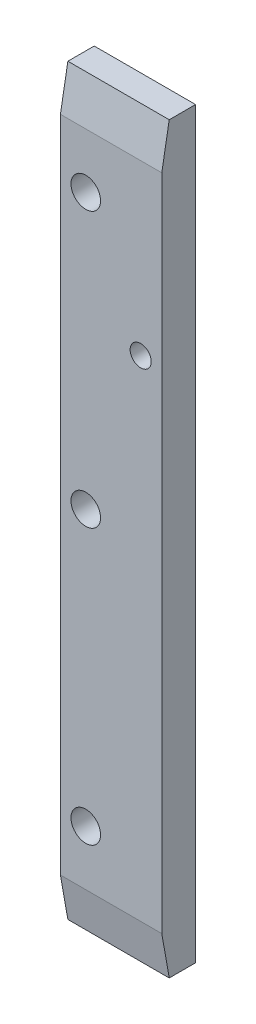
ISO-10303-21;
HEADER;
FILE_DESCRIPTION(('STEP AP214'),'2;1');
FILE_NAME('part.step','',(''),(''),'','','');
FILE_SCHEMA(('AUTOMOTIVE_DESIGN { 1 0 10303 214 1 1 1 1 }'));
ENDSEC;
DATA;
#1=APPLICATION_CONTEXT('core data for automotive mechanical design processes');
#2=APPLICATION_PROTOCOL_DEFINITION('international standard','automotive_design',2000,#1);
#3=PRODUCT_CONTEXT('',#1,'mechanical');
#4=PRODUCT('Part','Part','',(#3));
#5=PRODUCT_RELATED_PRODUCT_CATEGORY('part','',(#4));
#6=PRODUCT_DEFINITION_FORMATION('','',#4);
#7=PRODUCT_DEFINITION_CONTEXT('part definition',#1,'design');
#8=PRODUCT_DEFINITION('design','',#6,#7);
#9=PRODUCT_DEFINITION_SHAPE('','',#8);
#10=(LENGTH_UNIT() NAMED_UNIT(*) SI_UNIT(.MILLI.,.METRE.));
#11=(NAMED_UNIT(*) PLANE_ANGLE_UNIT() SI_UNIT($,.RADIAN.));
#12=(NAMED_UNIT(*) SI_UNIT($,.STERADIAN.) SOLID_ANGLE_UNIT());
#13=UNCERTAINTY_MEASURE_WITH_UNIT(LENGTH_MEASURE(1.E-05),#10,'distance_accuracy_value','');
#14=(GEOMETRIC_REPRESENTATION_CONTEXT(3) GLOBAL_UNCERTAINTY_ASSIGNED_CONTEXT((#13)) GLOBAL_UNIT_ASSIGNED_CONTEXT((#10,
#11,#12)) REPRESENTATION_CONTEXT('',''));
#15=CARTESIAN_POINT('',(0.,0.,0.));
#16=DIRECTION('',(0.,0.,1.));
#17=DIRECTION('',(1.,0.,0.));
#18=AXIS2_PLACEMENT_3D('',#15,#16,#17);
#19=CARTESIAN_POINT('',(0.,0.,4.));
#20=DIRECTION('',(0.,0.,-1.));
#21=DIRECTION('',(-1.,0.,0.));
#22=AXIS2_PLACEMENT_3D('',#19,#20,#21);
#23=PLANE('',#22);
#24=CARTESIAN_POINT('',(-2.50000000000001,-25.,4.));
#25=DIRECTION('',(0.,0.,1.));
#26=DIRECTION('',(1.,0.,0.));
#27=AXIS2_PLACEMENT_3D('',#24,#25,#26);
#28=CIRCLE('',#27,1.24999999999999);
#29=CARTESIAN_POINT('',(-1.25000000000002,-25.,4.));
#30=VERTEX_POINT('',#29);
#31=EDGE_CURVE('E131',#30,#30,#28,.T.);
#32=ORIENTED_EDGE('',*,*,#31,.F.);
#33=EDGE_LOOP('',(#32));
#34=FACE_BOUND('',#33,.T.);
#35=DIRECTION('',(0.,1.,0.));
#36=VECTOR('',#35,1.);
#37=CARTESIAN_POINT('',(0.,-83.,4.));
#38=LINE('',#37,#36);
#39=CARTESIAN_POINT('',(0.,-82.9999999999999,4.));
#40=VERTEX_POINT('',#39);
#41=CARTESIAN_POINT('',(0.,-5.00000000000013,4.));
#42=VERTEX_POINT('',#41);
#43=EDGE_CURVE('E104',#40,#42,#38,.T.);
#44=ORIENTED_EDGE('',*,*,#43,.T.);
#45=DIRECTION('',(-1.,0.,0.));
#46=VECTOR('',#45,1.);
#47=CARTESIAN_POINT('',(0.,-5.00000000000013,4.));
#48=LINE('',#47,#46);
#49=CARTESIAN_POINT('',(-12.,-5.00000000000013,4.));
#50=VERTEX_POINT('',#49);
#51=EDGE_CURVE('E141',#42,#50,#48,.T.);
#52=ORIENTED_EDGE('',*,*,#51,.T.);
#53=DIRECTION('',(0.,-1.,0.));
#54=VECTOR('',#53,1.);
#55=CARTESIAN_POINT('',(-12.,-4.99999999999998,4.));
#56=LINE('',#55,#54);
#57=CARTESIAN_POINT('',(-12.,-82.9999999999999,4.));
#58=VERTEX_POINT('',#57);
#59=EDGE_CURVE('E119',#50,#58,#56,.T.);
#60=ORIENTED_EDGE('',*,*,#59,.T.);
#61=DIRECTION('',(1.,0.,0.));
#62=VECTOR('',#61,1.);
#63=CARTESIAN_POINT('',(0.,-82.9999999999999,4.));
#64=LINE('',#63,#62);
#65=EDGE_CURVE('E93',#58,#40,#64,.T.);
#66=ORIENTED_EDGE('',*,*,#65,.T.);
#67=EDGE_LOOP('',(#44,#52,#60,#66));
#68=FACE_BOUND('',#67,.T.);
#69=CARTESIAN_POINT('',(-8.9999999999999,-76.5,4.));
#70=DIRECTION('',(0.,0.,1.));
#71=DIRECTION('',(1.,0.,0.));
#72=AXIS2_PLACEMENT_3D('',#69,#70,#71);
#73=CIRCLE('',#72,1.74999999999992);
#74=CARTESIAN_POINT('',(-7.24999999999998,-76.5,4.));
#75=VERTEX_POINT('',#74);
#76=EDGE_CURVE('E112',#75,#75,#73,.T.);
#77=ORIENTED_EDGE('',*,*,#76,.F.);
#78=EDGE_LOOP('',(#77));
#79=FACE_BOUND('',#78,.T.);
#80=CARTESIAN_POINT('',(-8.9999999999999,-44.,4.));
#81=DIRECTION('',(0.,0.,1.));
#82=DIRECTION('',(1.,0.,0.));
#83=AXIS2_PLACEMENT_3D('',#80,#81,#82);
#84=CIRCLE('',#83,1.74999999999992);
#85=CARTESIAN_POINT('',(-7.24999999999998,-44.,4.));
#86=VERTEX_POINT('',#85);
#87=EDGE_CURVE('E156',#86,#86,#84,.T.);
#88=ORIENTED_EDGE('',*,*,#87,.F.);
#89=EDGE_LOOP('',(#88));
#90=FACE_BOUND('',#89,.T.);
#91=CARTESIAN_POINT('',(-8.9999999999999,-11.5,4.));
#92=DIRECTION('',(0.,0.,1.));
#93=DIRECTION('',(1.,0.,0.));
#94=AXIS2_PLACEMENT_3D('',#91,#92,#93);
#95=CIRCLE('',#94,1.74999999999992);
#96=CARTESIAN_POINT('',(-7.24999999999998,-11.5,4.));
#97=VERTEX_POINT('',#96);
#98=EDGE_CURVE('E161',#97,#97,#95,.T.);
#99=ORIENTED_EDGE('',*,*,#98,.F.);
#100=EDGE_LOOP('',(#99));
#101=FACE_BOUND('',#100,.T.);
#102=ADVANCED_FACE('F37',(#34,#68,#79,#90,#101),#23,.F.);
#103=CARTESIAN_POINT('',(0.,0.,0.));
#104=DIRECTION('',(0.,0.,-1.));
#105=DIRECTION('',(-1.,0.,0.));
#106=AXIS2_PLACEMENT_3D('',#103,#104,#105);
#107=PLANE('',#106);
#108=CARTESIAN_POINT('',(-2.50000000000001,-25.,0.));
#109=DIRECTION('',(0.,0.,-1.));
#110=DIRECTION('',(-1.,0.,0.));
#111=AXIS2_PLACEMENT_3D('',#108,#109,#110);
#112=CIRCLE('',#111,1.24999999999999);
#113=CARTESIAN_POINT('',(-3.75,-25.,0.));
#114=VERTEX_POINT('',#113);
#115=EDGE_CURVE('E127',#114,#114,#112,.T.);
#116=ORIENTED_EDGE('',*,*,#115,.F.);
#117=EDGE_LOOP('',(#116));
#118=FACE_BOUND('',#117,.T.);
#119=CARTESIAN_POINT('',(-8.9999999999999,-44.,0.));
#120=DIRECTION('',(0.,0.,1.));
#121=DIRECTION('',(1.,0.,0.));
#122=AXIS2_PLACEMENT_3D('',#119,#120,#121);
#123=CIRCLE('',#122,1.74999999999992);
#124=CARTESIAN_POINT('',(-7.24999999999998,-44.,0.));
#125=VERTEX_POINT('',#124);
#126=EDGE_CURVE('E158',#125,#125,#123,.T.);
#127=ORIENTED_EDGE('',*,*,#126,.T.);
#128=EDGE_LOOP('',(#127));
#129=FACE_BOUND('',#128,.T.);
#130=DIRECTION('',(-1.,0.,0.));
#131=VECTOR('',#130,1.);
#132=CARTESIAN_POINT('',(-12.,0.,0.));
#133=LINE('',#132,#131);
#134=CARTESIAN_POINT('',(0.,0.,0.));
#135=VERTEX_POINT('',#134);
#136=CARTESIAN_POINT('',(-12.,0.,0.));
#137=VERTEX_POINT('',#136);
#138=EDGE_CURVE('E90',#135,#137,#133,.T.);
#139=ORIENTED_EDGE('',*,*,#138,.F.);
#140=DIRECTION('',(0.,1.,0.));
#141=VECTOR('',#140,1.);
#142=CARTESIAN_POINT('',(0.,-83.,0.));
#143=LINE('',#142,#141);
#144=CARTESIAN_POINT('',(0.,-88.,0.));
#145=VERTEX_POINT('',#144);
#146=EDGE_CURVE('E97',#145,#135,#143,.T.);
#147=ORIENTED_EDGE('',*,*,#146,.F.);
#148=DIRECTION('',(1.,0.,0.));
#149=VECTOR('',#148,1.);
#150=CARTESIAN_POINT('',(0.,-88.,0.));
#151=LINE('',#150,#149);
#152=CARTESIAN_POINT('',(-12.,-88.,0.));
#153=VERTEX_POINT('',#152);
#154=EDGE_CURVE('E105',#153,#145,#151,.T.);
#155=ORIENTED_EDGE('',*,*,#154,.F.);
#156=DIRECTION('',(0.,-1.,0.));
#157=VECTOR('',#156,1.);
#158=CARTESIAN_POINT('',(-12.,-88.,0.));
#159=LINE('',#158,#157);
#160=EDGE_CURVE('E111',#137,#153,#159,.T.);
#161=ORIENTED_EDGE('',*,*,#160,.F.);
#162=EDGE_LOOP('',(#139,#147,#155,#161));
#163=FACE_BOUND('',#162,.T.);
#164=CARTESIAN_POINT('',(-8.9999999999999,-76.5,0.));
#165=DIRECTION('',(0.,0.,1.));
#166=DIRECTION('',(1.,0.,0.));
#167=AXIS2_PLACEMENT_3D('',#164,#165,#166);
#168=CIRCLE('',#167,1.74999999999992);
#169=CARTESIAN_POINT('',(-7.24999999999998,-76.5,0.));
#170=VERTEX_POINT('',#169);
#171=EDGE_CURVE('E116',#170,#170,#168,.T.);
#172=ORIENTED_EDGE('',*,*,#171,.T.);
#173=EDGE_LOOP('',(#172));
#174=FACE_BOUND('',#173,.T.);
#175=CARTESIAN_POINT('',(-8.9999999999999,-11.5,0.));
#176=DIRECTION('',(0.,0.,1.));
#177=DIRECTION('',(1.,0.,0.));
#178=AXIS2_PLACEMENT_3D('',#175,#176,#177);
#179=CIRCLE('',#178,1.74999999999992);
#180=CARTESIAN_POINT('',(-7.24999999999998,-11.5,0.));
#181=VERTEX_POINT('',#180);
#182=EDGE_CURVE('E130',#181,#181,#179,.T.);
#183=ORIENTED_EDGE('',*,*,#182,.T.);
#184=EDGE_LOOP('',(#183));
#185=FACE_BOUND('',#184,.T.);
#186=ADVANCED_FACE('F108',(#118,#129,#163,#174,#185),#107,.T.);
#187=CARTESIAN_POINT('',(-12.,0.,4.));
#188=DIRECTION('',(0.,-1.,0.));
#189=DIRECTION('',(0.,0.,-1.));
#190=AXIS2_PLACEMENT_3D('',#187,#188,#189);
#191=PLANE('',#190);
#192=DIRECTION('',(0.,0.,-1.));
#193=VECTOR('',#192,1.);
#194=CARTESIAN_POINT('',(-12.,0.,4.));
#195=LINE('',#194,#193);
#196=CARTESIAN_POINT('',(-12.,0.,3.11836509645768));
#197=VERTEX_POINT('',#196);
#198=EDGE_CURVE('E94',#197,#137,#195,.T.);
#199=ORIENTED_EDGE('',*,*,#198,.F.);
#200=DIRECTION('',(1.,0.,0.));
#201=VECTOR('',#200,1.);
#202=CARTESIAN_POINT('',(-12.,0.,3.11836509645768));
#203=LINE('',#202,#201);
#204=CARTESIAN_POINT('',(0.,0.,3.11836509645768));
#205=VERTEX_POINT('',#204);
#206=EDGE_CURVE('E45',#197,#205,#203,.T.);
#207=ORIENTED_EDGE('',*,*,#206,.T.);
#208=DIRECTION('',(0.,0.,-1.));
#209=VECTOR('',#208,1.);
#210=CARTESIAN_POINT('',(0.,0.,4.));
#211=LINE('',#210,#209);
#212=EDGE_CURVE('E86',#205,#135,#211,.T.);
#213=ORIENTED_EDGE('',*,*,#212,.T.);
#214=ORIENTED_EDGE('',*,*,#138,.T.);
#215=EDGE_LOOP('',(#199,#207,#213,#214));
#216=FACE_BOUND('',#215,.T.);
#217=ADVANCED_FACE('F88',(#216),#191,.F.);
#218=CARTESIAN_POINT('',(-12.,-88.,4.));
#219=DIRECTION('',(1.,0.,0.));
#220=DIRECTION('',(0.,0.,-1.));
#221=AXIS2_PLACEMENT_3D('',#218,#219,#220);
#222=PLANE('',#221);
#223=ORIENTED_EDGE('',*,*,#59,.F.);
#224=DIRECTION('',(0.,-0.984807753012209,0.173648177666927));
#225=VECTOR('',#224,1.);
#226=CARTESIAN_POINT('',(-12.,-5.00000000000013,4.));
#227=LINE('',#226,#225);
#228=EDGE_CURVE('E59',#50,#197,#227,.F.);
#229=ORIENTED_EDGE('',*,*,#228,.T.);
#230=ORIENTED_EDGE('',*,*,#198,.T.);
#231=ORIENTED_EDGE('',*,*,#160,.T.);
#232=DIRECTION('',(0.,0.,-1.));
#233=VECTOR('',#232,1.);
#234=CARTESIAN_POINT('',(-12.,-88.,4.));
#235=LINE('',#234,#233);
#236=CARTESIAN_POINT('',(-12.,-88.,3.11836509645768));
#237=VERTEX_POINT('',#236);
#238=EDGE_CURVE('E124',#237,#153,#235,.T.);
#239=ORIENTED_EDGE('',*,*,#238,.F.);
#240=DIRECTION('',(0.,-0.984807753012209,-0.173648177666927));
#241=VECTOR('',#240,1.);
#242=CARTESIAN_POINT('',(-12.,-82.9999999999999,4.));
#243=LINE('',#242,#241);
#244=EDGE_CURVE('E138',#237,#58,#243,.F.);
#245=ORIENTED_EDGE('',*,*,#244,.T.);
#246=EDGE_LOOP('',(#223,#229,#230,#231,#239,#245));
#247=FACE_BOUND('',#246,.T.);
#248=ADVANCED_FACE('F150',(#247),#222,.F.);
#249=CARTESIAN_POINT('',(0.,-88.,4.));
#250=DIRECTION('',(0.,1.,0.));
#251=DIRECTION('',(0.,0.,1.));
#252=AXIS2_PLACEMENT_3D('',#249,#250,#251);
#253=PLANE('',#252);
#254=DIRECTION('',(0.,0.,-1.));
#255=VECTOR('',#254,1.);
#256=CARTESIAN_POINT('',(0.,-88.,4.));
#257=LINE('',#256,#255);
#258=CARTESIAN_POINT('',(0.,-88.,3.11836509645768));
#259=VERTEX_POINT('',#258);
#260=EDGE_CURVE('E100',#259,#145,#257,.T.);
#261=ORIENTED_EDGE('',*,*,#260,.F.);
#262=DIRECTION('',(-1.,0.,0.));
#263=VECTOR('',#262,1.);
#264=CARTESIAN_POINT('',(0.,-88.,3.11836509645768));
#265=LINE('',#264,#263);
#266=EDGE_CURVE('E136',#259,#237,#265,.T.);
#267=ORIENTED_EDGE('',*,*,#266,.T.);
#268=ORIENTED_EDGE('',*,*,#238,.T.);
#269=ORIENTED_EDGE('',*,*,#154,.T.);
#270=EDGE_LOOP('',(#261,#267,#268,#269));
#271=FACE_BOUND('',#270,.T.);
#272=ADVANCED_FACE('F188',(#271),#253,.F.);
#273=CARTESIAN_POINT('',(0.,-83.,4.));
#274=DIRECTION('',(-1.,0.,0.));
#275=DIRECTION('',(0.,0.,1.));
#276=AXIS2_PLACEMENT_3D('',#273,#274,#275);
#277=PLANE('',#276);
#278=ORIENTED_EDGE('',*,*,#212,.F.);
#279=DIRECTION('',(0.,0.984807753012209,-0.173648177666927));
#280=VECTOR('',#279,1.);
#281=CARTESIAN_POINT('',(0.,-5.00000000000013,4.));
#282=LINE('',#281,#280);
#283=EDGE_CURVE('E11',#205,#42,#282,.F.);
#284=ORIENTED_EDGE('',*,*,#283,.T.);
#285=ORIENTED_EDGE('',*,*,#43,.F.);
#286=DIRECTION('',(0.,0.984807753012209,0.173648177666927));
#287=VECTOR('',#286,1.);
#288=CARTESIAN_POINT('',(0.,-82.9999999999999,4.));
#289=LINE('',#288,#287);
#290=EDGE_CURVE('E134',#40,#259,#289,.F.);
#291=ORIENTED_EDGE('',*,*,#290,.T.);
#292=ORIENTED_EDGE('',*,*,#260,.T.);
#293=ORIENTED_EDGE('',*,*,#146,.T.);
#294=EDGE_LOOP('',(#278,#284,#285,#291,#292,#293));
#295=FACE_BOUND('',#294,.T.);
#296=ADVANCED_FACE('F98',(#295),#277,.F.);
#297=CARTESIAN_POINT('',(-8.9999999999999,-76.5,4.));
#298=DIRECTION('',(0.,0.,-1.));
#299=DIRECTION('',(-1.,0.,0.));
#300=AXIS2_PLACEMENT_3D('',#297,#298,#299);
#301=CYLINDRICAL_SURFACE('',#300,1.74999999999992);
#302=ORIENTED_EDGE('',*,*,#76,.T.);
#303=EDGE_LOOP('',(#302));
#304=FACE_BOUND('',#303,.T.);
#305=ORIENTED_EDGE('',*,*,#171,.F.);
#306=EDGE_LOOP('',(#305));
#307=FACE_BOUND('',#306,.T.);
#308=ADVANCED_FACE('F183',(#304,#307),#301,.F.);
#309=CARTESIAN_POINT('',(-8.9999999999999,-44.,4.));
#310=DIRECTION('',(0.,0.,-1.));
#311=DIRECTION('',(-1.,0.,0.));
#312=AXIS2_PLACEMENT_3D('',#309,#310,#311);
#313=CYLINDRICAL_SURFACE('',#312,1.74999999999992);
#314=ORIENTED_EDGE('',*,*,#87,.T.);
#315=EDGE_LOOP('',(#314));
#316=FACE_BOUND('',#315,.T.);
#317=ORIENTED_EDGE('',*,*,#126,.F.);
#318=EDGE_LOOP('',(#317));
#319=FACE_BOUND('',#318,.T.);
#320=ADVANCED_FACE('F207',(#316,#319),#313,.F.);
#321=CARTESIAN_POINT('',(-8.9999999999999,-11.5,4.));
#322=DIRECTION('',(0.,0.,-1.));
#323=DIRECTION('',(-1.,0.,0.));
#324=AXIS2_PLACEMENT_3D('',#321,#322,#323);
#325=CYLINDRICAL_SURFACE('',#324,1.74999999999992);
#326=ORIENTED_EDGE('',*,*,#98,.T.);
#327=EDGE_LOOP('',(#326));
#328=FACE_BOUND('',#327,.T.);
#329=ORIENTED_EDGE('',*,*,#182,.F.);
#330=EDGE_LOOP('',(#329));
#331=FACE_BOUND('',#330,.T.);
#332=ADVANCED_FACE('F200',(#328,#331),#325,.F.);
#333=CARTESIAN_POINT('',(-2.50000000000001,-25.,4.));
#334=DIRECTION('',(0.,0.,1.));
#335=DIRECTION('',(1.,0.,0.));
#336=AXIS2_PLACEMENT_3D('',#333,#334,#335);
#337=CYLINDRICAL_SURFACE('',#336,1.24999999999999);
#338=ORIENTED_EDGE('',*,*,#115,.T.);
#339=EDGE_LOOP('',(#338));
#340=FACE_BOUND('',#339,.T.);
#341=ORIENTED_EDGE('',*,*,#31,.T.);
#342=EDGE_LOOP('',(#341));
#343=FACE_BOUND('',#342,.T.);
#344=ADVANCED_FACE('F171',(#340,#343),#337,.F.);
#345=CARTESIAN_POINT('',(0.,-82.9999999999999,4.));
#346=DIRECTION('',(0.,0.173648177666927,-0.984807753012209));
#347=DIRECTION('',(1.,0.,0.));
#348=AXIS2_PLACEMENT_3D('',#345,#346,#347);
#349=PLANE('',#348);
#350=ORIENTED_EDGE('',*,*,#244,.F.);
#351=ORIENTED_EDGE('',*,*,#266,.F.);
#352=ORIENTED_EDGE('',*,*,#290,.F.);
#353=ORIENTED_EDGE('',*,*,#65,.F.);
#354=EDGE_LOOP('',(#350,#351,#352,#353));
#355=FACE_BOUND('',#354,.T.);
#356=ADVANCED_FACE('F194',(#355),#349,.F.);
#357=CARTESIAN_POINT('',(0.,-5.00000000000013,4.));
#358=DIRECTION('',(0.,-0.173648177666927,-0.984807753012209));
#359=DIRECTION('',(-1.,0.,0.));
#360=AXIS2_PLACEMENT_3D('',#357,#358,#359);
#361=PLANE('',#360);
#362=ORIENTED_EDGE('',*,*,#283,.F.);
#363=ORIENTED_EDGE('',*,*,#206,.F.);
#364=ORIENTED_EDGE('',*,*,#228,.F.);
#365=ORIENTED_EDGE('',*,*,#51,.F.);
#366=EDGE_LOOP('',(#362,#363,#364,#365));
#367=FACE_BOUND('',#366,.T.);
#368=ADVANCED_FACE('F39',(#367),#361,.F.);
#369=CLOSED_SHELL('',(#102,#186,#217,#248,#272,#296,#308,#320,#332,#344,#356,#368));
#370=MANIFOLD_SOLID_BREP('B2',#369);
#371=ADVANCED_BREP_SHAPE_REPRESENTATION('',(#18,#370),#14);
#372=SHAPE_DEFINITION_REPRESENTATION(#9,#371);
ENDSEC;
END-ISO-10303-21;
